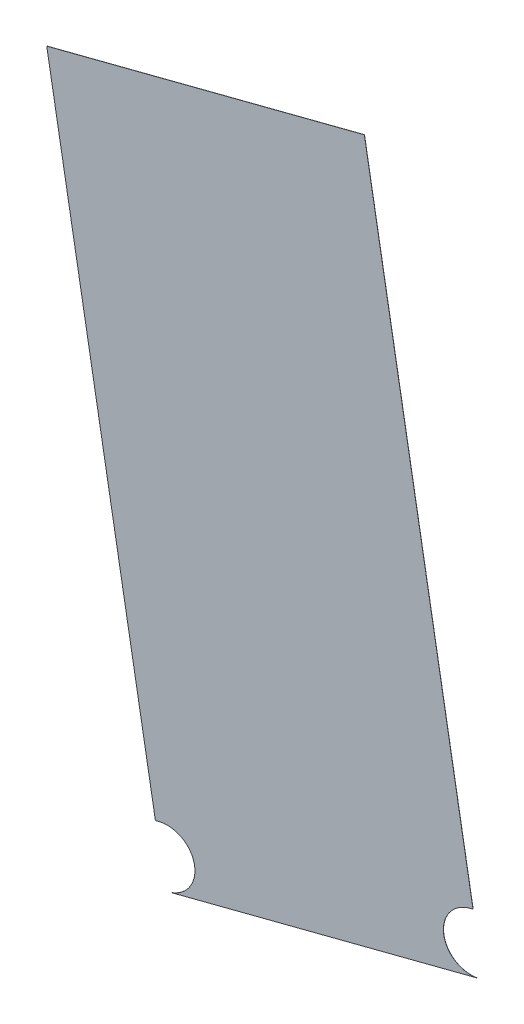
ISO-10303-21;
HEADER;
FILE_DESCRIPTION(('STEP AP214'),'2;1');
FILE_NAME('part.step','',(''),(''),'','','');
FILE_SCHEMA(('AUTOMOTIVE_DESIGN { 1 0 10303 214 1 1 1 1 }'));
ENDSEC;
DATA;
#1=APPLICATION_CONTEXT('core data for automotive mechanical design processes');
#2=APPLICATION_PROTOCOL_DEFINITION('international standard','automotive_design',2000,#1);
#3=PRODUCT_CONTEXT('',#1,'mechanical');
#4=PRODUCT('Part','Part','',(#3));
#5=PRODUCT_RELATED_PRODUCT_CATEGORY('part','',(#4));
#6=PRODUCT_DEFINITION_FORMATION('','',#4);
#7=PRODUCT_DEFINITION_CONTEXT('part definition',#1,'design');
#8=PRODUCT_DEFINITION('design','',#6,#7);
#9=PRODUCT_DEFINITION_SHAPE('','',#8);
#10=(LENGTH_UNIT() NAMED_UNIT(*) SI_UNIT(.MILLI.,.METRE.));
#11=(NAMED_UNIT(*) PLANE_ANGLE_UNIT() SI_UNIT($,.RADIAN.));
#12=(NAMED_UNIT(*) SI_UNIT($,.STERADIAN.) SOLID_ANGLE_UNIT());
#13=UNCERTAINTY_MEASURE_WITH_UNIT(LENGTH_MEASURE(1.E-05),#10,'distance_accuracy_value','');
#14=(GEOMETRIC_REPRESENTATION_CONTEXT(3) GLOBAL_UNCERTAINTY_ASSIGNED_CONTEXT((#13)) GLOBAL_UNIT_ASSIGNED_CONTEXT((#10,
#11,#12)) REPRESENTATION_CONTEXT('',''));
#15=CARTESIAN_POINT('',(0.,0.,0.));
#16=DIRECTION('',(0.,0.,1.));
#17=DIRECTION('',(1.,0.,0.));
#18=AXIS2_PLACEMENT_3D('',#15,#16,#17);
#19=CARTESIAN_POINT('',(-187.457927608856,-33.0538903851235,37.6378092698765));
#20=DIRECTION('',(-0.106409312295821,-0.0187628327566061,-0.994145368828763));
#21=DIRECTION('',(0.979042066843402,0.172631531635095,-0.108050847457676));
#22=AXIS2_PLACEMENT_3D('',#19,#20,#21);
#23=ELLIPSE('',#22,19.1621875404834,19.05);
#24=DIRECTION('',(-0.106409312295821,-0.0187628327566061,-0.994145368828763));
#25=VECTOR('',#24,1.);
#26=SURFACE_OF_LINEAR_EXTRUSION('',#23,#25);
#27=CARTESIAN_POINT('',(-187.468568540085,-33.0557666683991,37.5383947329936));
#28=DIRECTION('',(-0.106409312295821,-0.0187628327566061,-0.994145368828763));
#29=DIRECTION('',(0.979042066843402,0.172631531635095,-0.108050847457676));
#30=AXIS2_PLACEMENT_3D('',#27,#28,#29);
#31=ELLIPSE('',#30,19.1621875404834,19.05);
#32=CARTESIAN_POINT('',(-190.829757681754,-14.3046358343953,37.5442666038573));
#33=VERTEX_POINT('',#32);
#34=CARTESIAN_POINT('',(-182.487378081702,-51.4429970639022,37.352256439616));
#35=VERTEX_POINT('',#34);
#36=EDGE_CURVE('E250',#33,#35,#31,.T.);
#37=ORIENTED_EDGE('',*,*,#36,.T.);
#38=DIRECTION('',(-0.106409312295821,-0.0187628327566061,-0.994145368828763));
#39=VECTOR('',#38,1.);
#40=CARTESIAN_POINT('',(-182.476737150472,-51.4411207806265,37.4516709764989));
#41=LINE('',#40,#39);
#42=CARTESIAN_POINT('',(-182.476737150472,-51.4411207806265,37.4516709764989));
#43=VERTEX_POINT('',#42);
#44=EDGE_CURVE('E165',#35,#43,#41,.F.);
#45=ORIENTED_EDGE('',*,*,#44,.T.);
#46=CARTESIAN_POINT('',(-190.819116750524,-14.3027595511196,37.6436811407402));
#47=VERTEX_POINT('',#46);
#48=EDGE_CURVE('E160',#47,#43,#23,.T.);
#49=ORIENTED_EDGE('',*,*,#48,.F.);
#50=DIRECTION('',(0.106409312295821,0.0187628327566061,0.994145368828763));
#51=VECTOR('',#50,1.);
#52=CARTESIAN_POINT('',(-190.819116750524,-14.3027595511196,37.6436811407402));
#53=LINE('',#52,#51);
#54=EDGE_CURVE('E105',#33,#47,#53,.T.);
#55=ORIENTED_EDGE('',*,*,#54,.F.);
#56=EDGE_LOOP('',(#37,#45,#49,#55));
#57=FACE_BOUND('',#56,.T.);
#58=ADVANCED_FACE('F101',(#57),#26,.F.);
#59=CARTESIAN_POINT('',(0.106409312295811,0.0187628327566043,16.937487758155));
#60=DIRECTION('',(-0.106409312295811,-0.0187628327566043,-0.994145368828765));
#61=DIRECTION('',(-0.994320406448766,0.,0.106428047616977));
#62=AXIS2_PLACEMENT_3D('',#59,#60,#61);
#63=PLANE('',#62);
#64=DIRECTION('',(-0.979042066843752,-0.17263153163311,0.108050847457676));
#65=VECTOR('',#64,1.);
#66=CARTESIAN_POINT('',(-184.26973406258,-51.757274512558,37.6495530107885));
#67=LINE('',#66,#65);
#68=CARTESIAN_POINT('',(1.60801525867739,-18.9820121938603,17.1353697924578));
#69=VERTEX_POINT('',#68);
#70=EDGE_CURVE('E143',#69,#43,#67,.T.);
#71=ORIENTED_EDGE('',*,*,#70,.F.);
#72=CARTESIAN_POINT('',(0.,0.,16.9492314990629));
#73=DIRECTION('',(-0.106409312295811,-0.0187628327566043,-0.994145368828765));
#74=DIRECTION('',(0.979042066843403,0.172631531635095,-0.108050847457666));
#75=AXIS2_PLACEMENT_3D('',#72,#73,#74);
#76=ELLIPSE('',#75,19.1621875404836,19.05);
#77=CARTESIAN_POINT('',(-3.25477980273038,18.769893671402,16.9433596260794));
#78=VERTEX_POINT('',#77);
#79=EDGE_CURVE('E217',#69,#78,#76,.T.);
#80=ORIENTED_EDGE('',*,*,#79,.T.);
#81=CARTESIAN_POINT('',(0.106409312295811,0.0187628327566043,16.937487758155));
#82=DIRECTION('',(-0.106409312295811,-0.0187628327566043,-0.994145368828765));
#83=DIRECTION('',(0.979042066843403,0.172631531635095,-0.108050847457666));
#84=AXIS2_PLACEMENT_3D('',#81,#82,#83);
#85=ELLIPSE('',#84,19.1621875404836,19.05);
#86=CARTESIAN_POINT('',(-1.50160594638568,19.0007750266166,16.7513494647606));
#87=VERTEX_POINT('',#86);
#88=EDGE_CURVE('E282',#78,#87,#85,.T.);
#89=ORIENTED_EDGE('',*,*,#88,.T.);
#90=DIRECTION('',(-0.173648177666931,0.984807753012208,-2.17766061028204E-13));
#91=VECTOR('',#90,1.);
#92=CARTESIAN_POINT('',(-1.50160594638566,19.0007750266165,16.7513494647606));
#93=LINE('',#92,#91);
#94=CARTESIAN_POINT('',(-74.0912567282645,430.677141798284,16.7513494646695));
#95=VERTEX_POINT('',#94);
#96=EDGE_CURVE('E207',#87,#95,#93,.T.);
#97=ORIENTED_EDGE('',*,*,#96,.T.);
#98=DIRECTION('',(0.979042066843752,0.172631531633109,-0.108050847457676));
#99=VECTOR('',#98,1.);
#100=CARTESIAN_POINT('',(-265.135178161487,396.990943949263,37.8356913040794));
#101=LINE('',#100,#99);
#102=CARTESIAN_POINT('',(-265.135178161487,396.990943949263,37.8356913040794));
#103=VERTEX_POINT('',#102);
#104=EDGE_CURVE('E167',#103,#95,#101,.T.);
#105=ORIENTED_EDGE('',*,*,#104,.F.);
#106=DIRECTION('',(-0.17364817766693,0.984807753012208,-2.17791519910998E-13));
#107=VECTOR('',#106,1.);
#108=CARTESIAN_POINT('',(-192.54552737961,-14.6854228223973,37.8356913041705));
#109=LINE('',#108,#107);
#110=CARTESIAN_POINT('',(-192.54552737961,-14.6854228223973,37.8356913041705));
#111=VERTEX_POINT('',#110);
#112=EDGE_CURVE('E157',#111,#103,#109,.T.);
#113=ORIENTED_EDGE('',*,*,#112,.F.);
#114=CARTESIAN_POINT('',(-187.564336921151,-33.0726532178801,37.6495530107844));
#115=DIRECTION('',(-0.106409312295821,-0.0187628327566061,-0.994145368828763));
#116=DIRECTION('',(0.979042066843402,0.172631531635095,-0.108050847457676));
#117=AXIS2_PLACEMENT_3D('',#114,#115,#116);
#118=ELLIPSE('',#117,19.1621875404834,19.05);
#119=EDGE_CURVE('E152',#111,#47,#118,.T.);
#120=ORIENTED_EDGE('',*,*,#119,.T.);
#121=ORIENTED_EDGE('',*,*,#48,.T.);
#122=EDGE_LOOP('',(#71,#80,#89,#97,#105,#113,#120,#121));
#123=FACE_BOUND('',#122,.T.);
#124=ADVANCED_FACE('F103',(#123),#63,.F.);
#125=CARTESIAN_POINT('',(-187.574977852381,-33.0745295011557,37.5501384739015));
#126=DIRECTION('',(-0.106409312295821,-0.0187628327566061,-0.994145368828763));
#127=DIRECTION('',(-0.934355548636741,-0.340077607925243,0.106428047617061));
#128=AXIS2_PLACEMENT_3D('',#125,#126,#127);
#129=PLANE('',#128);
#130=DIRECTION('',(0.979042066843752,0.172631531633109,-0.108050847457676));
#131=VECTOR('',#130,1.);
#132=CARTESIAN_POINT('',(-265.145819092717,396.989067665988,37.7362767671965));
#133=LINE('',#132,#131);
#134=CARTESIAN_POINT('',(-265.145819092717,396.989067665988,37.7362767671965));
#135=VERTEX_POINT('',#134);
#136=CARTESIAN_POINT('',(-74.1018976594941,430.675265515008,16.6519349277867));
#137=VERTEX_POINT('',#136);
#138=EDGE_CURVE('E253',#135,#137,#133,.T.);
#139=ORIENTED_EDGE('',*,*,#138,.T.);
#140=DIRECTION('',(-0.173648177666931,0.984807753012208,-2.17766061028204E-13));
#141=VECTOR('',#140,1.);
#142=CARTESIAN_POINT('',(-1.51224687761524,18.9988987433409,16.6519349278777));
#143=LINE('',#142,#141);
#144=CARTESIAN_POINT('',(-1.51224687761526,18.9988987433409,16.6519349278777));
#145=VERTEX_POINT('',#144);
#146=EDGE_CURVE('E243',#145,#137,#143,.T.);
#147=ORIENTED_EDGE('',*,*,#146,.F.);
#148=CARTESIAN_POINT('',(0.0957683810662297,0.0168865494809438,16.8380732212721));
#149=DIRECTION('',(-0.106409312295811,-0.0187628327566043,-0.994145368828765));
#150=DIRECTION('',(0.979042066843403,0.172631531635095,-0.108050847457666));
#151=AXIS2_PLACEMENT_3D('',#148,#149,#150);
#152=ELLIPSE('',#151,19.1621875404836,19.05);
#153=CARTESIAN_POINT('',(-3.26542073395996,18.7680173881264,16.8439450891965));
#154=VERTEX_POINT('',#153);
#155=EDGE_CURVE('E226',#154,#145,#152,.T.);
#156=ORIENTED_EDGE('',*,*,#155,.F.);
#157=CARTESIAN_POINT('',(-0.0106409312295815,-0.00187628327566054,16.84981696218));
#158=DIRECTION('',(-0.106409312295811,-0.0187628327566043,-0.994145368828765));
#159=DIRECTION('',(0.979042066843403,0.172631531635095,-0.108050847457666));
#160=AXIS2_PLACEMENT_3D('',#157,#158,#159);
#161=ELLIPSE('',#160,19.1621875404836,19.05);
#162=CARTESIAN_POINT('',(1.59737432744786,-18.9838884771359,17.0359552555749));
#163=VERTEX_POINT('',#162);
#164=EDGE_CURVE('E214',#163,#154,#161,.T.);
#165=ORIENTED_EDGE('',*,*,#164,.F.);
#166=DIRECTION('',(-0.979042066843752,-0.17263153163311,0.108050847457676));
#167=VECTOR('',#166,1.);
#168=CARTESIAN_POINT('',(-184.280374993809,-51.7591507958336,37.5501384739057));
#169=LINE('',#168,#167);
#170=EDGE_CURVE('E197',#163,#35,#169,.T.);
#171=ORIENTED_EDGE('',*,*,#170,.T.);
#172=ORIENTED_EDGE('',*,*,#36,.F.);
#173=CARTESIAN_POINT('',(-187.574977852381,-33.0745295011557,37.5501384739015));
#174=DIRECTION('',(-0.106409312295821,-0.0187628327566061,-0.994145368828763));
#175=DIRECTION('',(0.979042066843402,0.172631531635095,-0.108050847457676));
#176=AXIS2_PLACEMENT_3D('',#173,#174,#175);
#177=ELLIPSE('',#176,19.1621875404834,19.05);
#178=CARTESIAN_POINT('',(-192.556168310839,-14.687299105673,37.7362767672876));
#179=VERTEX_POINT('',#178);
#180=EDGE_CURVE('E155',#179,#33,#177,.T.);
#181=ORIENTED_EDGE('',*,*,#180,.F.);
#182=DIRECTION('',(-0.17364817766693,0.984807753012208,-2.17791519910998E-13));
#183=VECTOR('',#182,1.);
#184=CARTESIAN_POINT('',(-192.556168310839,-14.687299105673,37.7362767672876));
#185=LINE('',#184,#183);
#186=EDGE_CURVE('E163',#179,#135,#185,.T.);
#187=ORIENTED_EDGE('',*,*,#186,.T.);
#188=EDGE_LOOP('',(#139,#147,#156,#165,#171,#172,#181,#187));
#189=FACE_BOUND('',#188,.T.);
#190=ADVANCED_FACE('F223',(#189),#129,.T.);
#191=CARTESIAN_POINT('',(-265.135178161487,396.990943949263,37.8356913040794));
#192=DIRECTION('',(-0.173648177666929,0.984807753012208,-2.17935838786632E-13));
#193=DIRECTION('',(0.979042066843752,0.172631531633109,-0.108050847457676));
#194=AXIS2_PLACEMENT_3D('',#191,#192,#193);
#195=PLANE('',#194);
#196=ORIENTED_EDGE('',*,*,#104,.T.);
#197=DIRECTION('',(0.106409312295811,0.0187628327566043,0.994145368828765));
#198=VECTOR('',#197,1.);
#199=CARTESIAN_POINT('',(-74.0912567282645,430.677141798284,16.7513494646695));
#200=LINE('',#199,#198);
#201=EDGE_CURVE('E239',#137,#95,#200,.T.);
#202=ORIENTED_EDGE('',*,*,#201,.F.);
#203=ORIENTED_EDGE('',*,*,#138,.F.);
#204=DIRECTION('',(0.106409312295821,0.0187628327566061,0.994145368828763));
#205=VECTOR('',#204,1.);
#206=CARTESIAN_POINT('',(-265.135178161487,396.990943949263,37.8356913040794));
#207=LINE('',#206,#205);
#208=EDGE_CURVE('E13',#135,#103,#207,.T.);
#209=ORIENTED_EDGE('',*,*,#208,.T.);
#210=EDGE_LOOP('',(#196,#202,#203,#209));
#211=FACE_BOUND('',#210,.T.);
#212=ADVANCED_FACE('F180',(#211),#195,.T.);
#213=CARTESIAN_POINT('',(-192.54552737961,-14.6854228223973,37.8356913041705));
#214=DIRECTION('',(-0.979042066843752,-0.17263153163311,0.108050847457676));
#215=DIRECTION('',(-0.17364817766693,0.984807753012208,-2.17791519910998E-13));
#216=AXIS2_PLACEMENT_3D('',#213,#214,#215);
#217=PLANE('',#216);
#218=ORIENTED_EDGE('',*,*,#208,.F.);
#219=ORIENTED_EDGE('',*,*,#186,.F.);
#220=DIRECTION('',(0.106409312295821,0.0187628327566061,0.994145368828763));
#221=VECTOR('',#220,1.);
#222=CARTESIAN_POINT('',(-192.54552737961,-14.6854228223973,37.8356913041705));
#223=LINE('',#222,#221);
#224=EDGE_CURVE('E112',#179,#111,#223,.T.);
#225=ORIENTED_EDGE('',*,*,#224,.T.);
#226=ORIENTED_EDGE('',*,*,#112,.T.);
#227=EDGE_LOOP('',(#218,#219,#225,#226));
#228=FACE_BOUND('',#227,.T.);
#229=ADVANCED_FACE('F192',(#228),#217,.T.);
#230=DIRECTION('',(-0.106409312295821,-0.0187628327566061,-0.994145368828763));
#231=VECTOR('',#230,1.);
#232=SURFACE_OF_LINEAR_EXTRUSION('',#118,#231);
#233=ORIENTED_EDGE('',*,*,#224,.F.);
#234=ORIENTED_EDGE('',*,*,#180,.T.);
#235=ORIENTED_EDGE('',*,*,#54,.T.);
#236=ORIENTED_EDGE('',*,*,#119,.F.);
#237=EDGE_LOOP('',(#233,#234,#235,#236));
#238=FACE_BOUND('',#237,.T.);
#239=ADVANCED_FACE('F151',(#238),#232,.F.);
#240=CARTESIAN_POINT('',(-187.749318574652,-52.3708191436953,21.0843418394141));
#241=DIRECTION('',(0.17364817766693,-0.984807753012208,2.17781467115463E-13));
#242=DIRECTION('',(-0.961812520270323,-0.169593497706818,0.214836499196058));
#243=AXIS2_PLACEMENT_3D('',#240,#241,#242);
#244=PLANE('',#243);
#245=ORIENTED_EDGE('',*,*,#170,.F.);
#246=DIRECTION('',(-0.106409312295811,-0.0187628327566043,-0.994145368828765));
#247=VECTOR('',#246,1.);
#248=CARTESIAN_POINT('',(1.60801525867739,-18.9820121938603,17.1353697924578));
#249=LINE('',#248,#247);
#250=EDGE_CURVE('E200',#69,#163,#249,.T.);
#251=ORIENTED_EDGE('',*,*,#250,.F.);
#252=ORIENTED_EDGE('',*,*,#70,.T.);
#253=ORIENTED_EDGE('',*,*,#44,.F.);
#254=EDGE_LOOP('',(#245,#251,#252,#253));
#255=FACE_BOUND('',#254,.T.);
#256=ADVANCED_FACE('F182',(#255),#244,.T.);
#257=CARTESIAN_POINT('',(-1.50160594638566,19.0007750266165,16.7513494647606));
#258=DIRECTION('',(-0.979042066843753,-0.17263153163311,0.108050847457666));
#259=DIRECTION('',(-0.173648177666931,0.984807753012208,-2.17766061028204E-13));
#260=AXIS2_PLACEMENT_3D('',#257,#258,#259);
#261=PLANE('',#260);
#262=DIRECTION('',(0.106409312295811,0.0187628327566043,0.994145368828765));
#263=VECTOR('',#262,1.);
#264=CARTESIAN_POINT('',(-1.50160594638568,19.0007750266166,16.7513494647606));
#265=LINE('',#264,#263);
#266=EDGE_CURVE('E219',#145,#87,#265,.T.);
#267=ORIENTED_EDGE('',*,*,#266,.F.);
#268=ORIENTED_EDGE('',*,*,#146,.T.);
#269=ORIENTED_EDGE('',*,*,#201,.T.);
#270=ORIENTED_EDGE('',*,*,#96,.F.);
#271=EDGE_LOOP('',(#267,#268,#269,#270));
#272=FACE_BOUND('',#271,.T.);
#273=ADVANCED_FACE('F184',(#272),#261,.F.);
#274=DIRECTION('',(-0.106409312295811,-0.0187628327566043,-0.994145368828765));
#275=VECTOR('',#274,1.);
#276=SURFACE_OF_LINEAR_EXTRUSION('',#85,#275);
#277=DIRECTION('',(0.106409312295811,0.0187628327566043,0.994145368828765));
#278=VECTOR('',#277,1.);
#279=CARTESIAN_POINT('',(-3.25477980273038,18.769893671402,16.9433596260794));
#280=LINE('',#279,#278);
#281=EDGE_CURVE('E228',#154,#78,#280,.T.);
#282=ORIENTED_EDGE('',*,*,#281,.F.);
#283=ORIENTED_EDGE('',*,*,#155,.T.);
#284=ORIENTED_EDGE('',*,*,#266,.T.);
#285=ORIENTED_EDGE('',*,*,#88,.F.);
#286=EDGE_LOOP('',(#282,#283,#284,#285));
#287=FACE_BOUND('',#286,.T.);
#288=ADVANCED_FACE('F189',(#287),#276,.F.);
#289=DIRECTION('',(-0.106409312295811,-0.0187628327566043,-0.994145368828765));
#290=VECTOR('',#289,1.);
#291=SURFACE_OF_LINEAR_EXTRUSION('',#76,#290);
#292=ORIENTED_EDGE('',*,*,#79,.F.);
#293=ORIENTED_EDGE('',*,*,#250,.T.);
#294=ORIENTED_EDGE('',*,*,#164,.T.);
#295=ORIENTED_EDGE('',*,*,#281,.T.);
#296=EDGE_LOOP('',(#292,#293,#294,#295));
#297=FACE_BOUND('',#296,.T.);
#298=ADVANCED_FACE('F211',(#297),#291,.F.);
#299=CLOSED_SHELL('',(#58,#124,#190,#212,#229,#239,#256,#273,#288,#298));
#300=MANIFOLD_SOLID_BREP('B2',#299);
#301=ADVANCED_BREP_SHAPE_REPRESENTATION('',(#18,#300),#14);
#302=SHAPE_DEFINITION_REPRESENTATION(#9,#301);
ENDSEC;
END-ISO-10303-21;
